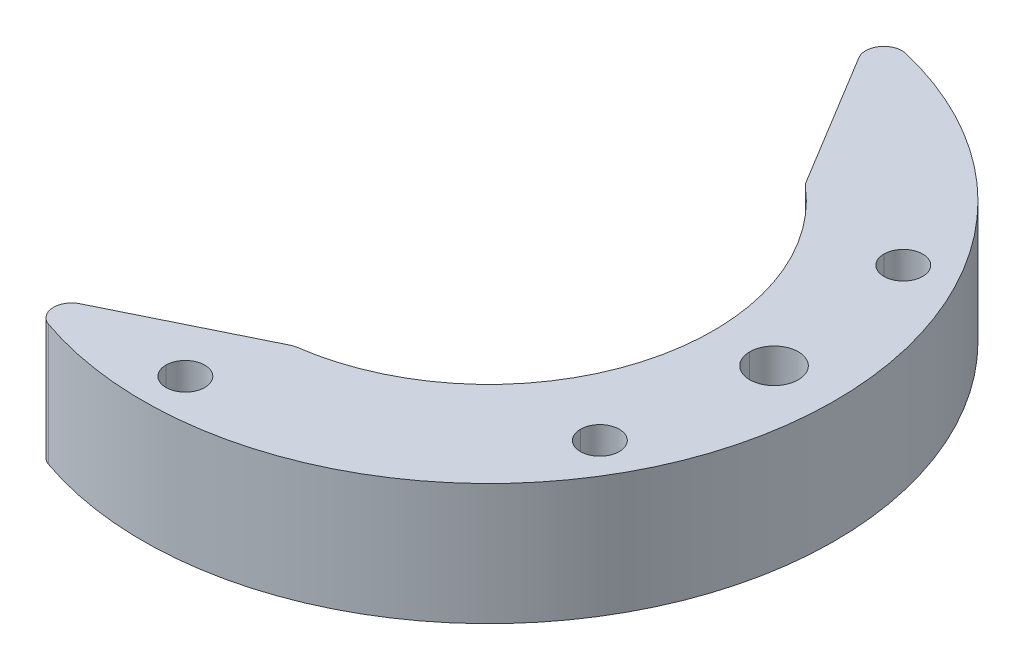
ISO-10303-21;
HEADER;
FILE_DESCRIPTION(('STEP AP214'),'2;1');
FILE_NAME('part.step','',(''),(''),'','','');
FILE_SCHEMA(('AUTOMOTIVE_DESIGN { 1 0 10303 214 1 1 1 1 }'));
ENDSEC;
DATA;
#1=APPLICATION_CONTEXT('core data for automotive mechanical design processes');
#2=APPLICATION_PROTOCOL_DEFINITION('international standard','automotive_design',2000,#1);
#3=PRODUCT_CONTEXT('',#1,'mechanical');
#4=PRODUCT('Part','Part','',(#3));
#5=PRODUCT_RELATED_PRODUCT_CATEGORY('part','',(#4));
#6=PRODUCT_DEFINITION_FORMATION('','',#4);
#7=PRODUCT_DEFINITION_CONTEXT('part definition',#1,'design');
#8=PRODUCT_DEFINITION('design','',#6,#7);
#9=PRODUCT_DEFINITION_SHAPE('','',#8);
#10=(LENGTH_UNIT() NAMED_UNIT(*) SI_UNIT(.MILLI.,.METRE.));
#11=(NAMED_UNIT(*) PLANE_ANGLE_UNIT() SI_UNIT($,.RADIAN.));
#12=(NAMED_UNIT(*) SI_UNIT($,.STERADIAN.) SOLID_ANGLE_UNIT());
#13=UNCERTAINTY_MEASURE_WITH_UNIT(LENGTH_MEASURE(1.E-05),#10,'distance_accuracy_value','');
#14=(GEOMETRIC_REPRESENTATION_CONTEXT(3) GLOBAL_UNCERTAINTY_ASSIGNED_CONTEXT((#13)) GLOBAL_UNIT_ASSIGNED_CONTEXT((#10,
#11,#12)) REPRESENTATION_CONTEXT('',''));
#15=CARTESIAN_POINT('',(0.,0.,0.));
#16=DIRECTION('',(0.,0.,1.));
#17=DIRECTION('',(1.,0.,0.));
#18=AXIS2_PLACEMENT_3D('',#15,#16,#17);
#19=CARTESIAN_POINT('',(23.5,-5.,0.));
#20=DIRECTION('',(0.,-1.,0.));
#21=DIRECTION('',(1.,0.,0.));
#22=AXIS2_PLACEMENT_3D('',#19,#20,#21);
#23=CYLINDRICAL_SURFACE('',#22,2.);
#24=DIRECTION('',(0.,1.,0.));
#25=VECTOR('',#24,1.);
#26=CARTESIAN_POINT('',(21.5,-5.,0.));
#27=LINE('',#26,#25);
#28=CARTESIAN_POINT('',(21.5,-5.,0.));
#29=VERTEX_POINT('',#28);
#30=CARTESIAN_POINT('',(21.5,5.,0.));
#31=VERTEX_POINT('',#30);
#32=EDGE_CURVE('E12',#29,#31,#27,.T.);
#33=ORIENTED_EDGE('',*,*,#32,.F.);
#34=CARTESIAN_POINT('',(23.5,-5.,0.));
#35=DIRECTION('',(0.,-1.,0.));
#36=DIRECTION('',(-1.,0.,0.));
#37=AXIS2_PLACEMENT_3D('',#34,#35,#36);
#38=CIRCLE('',#37,2.);
#39=CARTESIAN_POINT('',(25.5,-5.,0.));
#40=VERTEX_POINT('',#39);
#41=EDGE_CURVE('E29',#29,#40,#38,.T.);
#42=ORIENTED_EDGE('',*,*,#41,.T.);
#43=DIRECTION('',(0.,1.,0.));
#44=VECTOR('',#43,1.);
#45=CARTESIAN_POINT('',(25.5,-5.,0.));
#46=LINE('',#45,#44);
#47=CARTESIAN_POINT('',(25.5,5.,0.));
#48=VERTEX_POINT('',#47);
#49=EDGE_CURVE('E210',#40,#48,#46,.T.);
#50=ORIENTED_EDGE('',*,*,#49,.T.);
#51=CARTESIAN_POINT('',(23.5,5.,0.));
#52=DIRECTION('',(0.,-1.,0.));
#53=DIRECTION('',(-1.,0.,0.));
#54=AXIS2_PLACEMENT_3D('',#51,#52,#53);
#55=CIRCLE('',#54,2.);
#56=EDGE_CURVE('E214',#31,#48,#55,.T.);
#57=ORIENTED_EDGE('',*,*,#56,.F.);
#58=EDGE_LOOP('',(#33,#42,#50,#57));
#59=FACE_BOUND('',#58,.T.);
#60=ADVANCED_FACE('F20',(#59),#23,.F.);
#61=CARTESIAN_POINT('',(23.5,-5.,0.));
#62=DIRECTION('',(0.,-1.,0.));
#63=DIRECTION('',(1.,0.,0.));
#64=AXIS2_PLACEMENT_3D('',#61,#62,#63);
#65=CYLINDRICAL_SURFACE('',#64,2.);
#66=ORIENTED_EDGE('',*,*,#49,.F.);
#67=CARTESIAN_POINT('',(23.5,-5.,0.));
#68=DIRECTION('',(0.,-1.,0.));
#69=DIRECTION('',(1.,0.,0.));
#70=AXIS2_PLACEMENT_3D('',#67,#68,#69);
#71=CIRCLE('',#70,2.);
#72=EDGE_CURVE('E219',#40,#29,#71,.T.);
#73=ORIENTED_EDGE('',*,*,#72,.T.);
#74=ORIENTED_EDGE('',*,*,#32,.T.);
#75=CARTESIAN_POINT('',(23.5,5.,0.));
#76=DIRECTION('',(0.,-1.,0.));
#77=DIRECTION('',(1.,0.,0.));
#78=AXIS2_PLACEMENT_3D('',#75,#76,#77);
#79=CIRCLE('',#78,2.);
#80=EDGE_CURVE('E227',#48,#31,#79,.T.);
#81=ORIENTED_EDGE('',*,*,#80,.F.);
#82=EDGE_LOOP('',(#66,#73,#74,#81));
#83=FACE_BOUND('',#82,.T.);
#84=ADVANCED_FACE('F504',(#83),#65,.F.);
#85=CARTESIAN_POINT('',(0.,-5.,25.));
#86=DIRECTION('',(0.,-1.,0.));
#87=DIRECTION('',(1.,0.,0.));
#88=AXIS2_PLACEMENT_3D('',#85,#86,#87);
#89=CYLINDRICAL_SURFACE('',#88,1.6);
#90=DIRECTION('',(0.,1.,0.));
#91=VECTOR('',#90,1.);
#92=CARTESIAN_POINT('',(1.6,-2.,25.));
#93=LINE('',#92,#91);
#94=CARTESIAN_POINT('',(1.6,-2.,25.));
#95=VERTEX_POINT('',#94);
#96=CARTESIAN_POINT('',(1.6,5.,25.));
#97=VERTEX_POINT('',#96);
#98=EDGE_CURVE('E231',#95,#97,#93,.T.);
#99=ORIENTED_EDGE('',*,*,#98,.T.);
#100=CARTESIAN_POINT('',(0.,5.,25.));
#101=DIRECTION('',(0.,-1.,0.));
#102=DIRECTION('',(-1.,0.,0.));
#103=AXIS2_PLACEMENT_3D('',#100,#101,#102);
#104=CIRCLE('',#103,1.6);
#105=CARTESIAN_POINT('',(-1.6,5.,25.));
#106=VERTEX_POINT('',#105);
#107=EDGE_CURVE('E235',#106,#97,#104,.T.);
#108=ORIENTED_EDGE('',*,*,#107,.F.);
#109=DIRECTION('',(0.,1.,0.));
#110=VECTOR('',#109,1.);
#111=CARTESIAN_POINT('',(-1.6,-2.,25.));
#112=LINE('',#111,#110);
#113=CARTESIAN_POINT('',(-1.6,-2.,25.));
#114=VERTEX_POINT('',#113);
#115=EDGE_CURVE('E240',#114,#106,#112,.T.);
#116=ORIENTED_EDGE('',*,*,#115,.F.);
#117=CARTESIAN_POINT('',(0.,-2.,25.));
#118=DIRECTION('',(0.,-1.,0.));
#119=DIRECTION('',(-1.,0.,0.));
#120=AXIS2_PLACEMENT_3D('',#117,#118,#119);
#121=CIRCLE('',#120,1.6);
#122=EDGE_CURVE('E254',#114,#95,#121,.T.);
#123=ORIENTED_EDGE('',*,*,#122,.T.);
#124=EDGE_LOOP('',(#99,#108,#116,#123));
#125=FACE_BOUND('',#124,.T.);
#126=ADVANCED_FACE('F508',(#125),#89,.F.);
#127=CARTESIAN_POINT('',(0.,-5.,25.));
#128=DIRECTION('',(0.,-1.,0.));
#129=DIRECTION('',(1.,0.,0.));
#130=AXIS2_PLACEMENT_3D('',#127,#128,#129);
#131=CYLINDRICAL_SURFACE('',#130,1.6);
#132=ORIENTED_EDGE('',*,*,#115,.T.);
#133=CARTESIAN_POINT('',(0.,5.,25.));
#134=DIRECTION('',(0.,-1.,0.));
#135=DIRECTION('',(1.,0.,0.));
#136=AXIS2_PLACEMENT_3D('',#133,#134,#135);
#137=CIRCLE('',#136,1.6);
#138=EDGE_CURVE('E249',#97,#106,#137,.T.);
#139=ORIENTED_EDGE('',*,*,#138,.F.);
#140=ORIENTED_EDGE('',*,*,#98,.F.);
#141=CARTESIAN_POINT('',(0.,-2.,25.));
#142=DIRECTION('',(0.,-1.,0.));
#143=DIRECTION('',(1.,0.,0.));
#144=AXIS2_PLACEMENT_3D('',#141,#142,#143);
#145=CIRCLE('',#144,1.6);
#146=EDGE_CURVE('E255',#95,#114,#145,.T.);
#147=ORIENTED_EDGE('',*,*,#146,.T.);
#148=EDGE_LOOP('',(#132,#139,#140,#147));
#149=FACE_BOUND('',#148,.T.);
#150=ADVANCED_FACE('F513',(#149),#131,.F.);
#151=CARTESIAN_POINT('',(0.,-2.,0.));
#152=DIRECTION('',(0.,-1.,0.));
#153=DIRECTION('',(1.,0.,0.));
#154=AXIS2_PLACEMENT_3D('',#151,#152,#153);
#155=PLANE('',#154);
#156=ORIENTED_EDGE('',*,*,#122,.F.);
#157=ORIENTED_EDGE('',*,*,#146,.F.);
#158=EDGE_LOOP('',(#156,#157));
#159=FACE_BOUND('',#158,.T.);
#160=CARTESIAN_POINT('',(0.,-2.,25.));
#161=DIRECTION('',(0.,-1.,0.));
#162=DIRECTION('',(-1.,0.,0.));
#163=AXIS2_PLACEMENT_3D('',#160,#161,#162);
#164=CIRCLE('',#163,2.75);
#165=CARTESIAN_POINT('',(-2.75,-2.,25.));
#166=VERTEX_POINT('',#165);
#167=CARTESIAN_POINT('',(2.75,-2.,25.));
#168=VERTEX_POINT('',#167);
#169=EDGE_CURVE('E792',#166,#168,#164,.T.);
#170=ORIENTED_EDGE('',*,*,#169,.T.);
#171=CARTESIAN_POINT('',(0.,-2.,25.));
#172=DIRECTION('',(0.,-1.,0.));
#173=DIRECTION('',(1.,0.,0.));
#174=AXIS2_PLACEMENT_3D('',#171,#172,#173);
#175=CIRCLE('',#174,2.75);
#176=EDGE_CURVE('E794',#168,#166,#175,.T.);
#177=ORIENTED_EDGE('',*,*,#176,.T.);
#178=EDGE_LOOP('',(#170,#177));
#179=FACE_BOUND('',#178,.T.);
#180=ADVANCED_FACE('F519',(#159,#179),#155,.T.);
#181=CARTESIAN_POINT('',(0.,-5.,25.));
#182=DIRECTION('',(0.,-1.,0.));
#183=DIRECTION('',(1.,0.,0.));
#184=AXIS2_PLACEMENT_3D('',#181,#182,#183);
#185=CYLINDRICAL_SURFACE('',#184,2.75);
#186=DIRECTION('',(0.,1.,0.));
#187=VECTOR('',#186,1.);
#188=CARTESIAN_POINT('',(2.75,-5.,25.));
#189=LINE('',#188,#187);
#190=CARTESIAN_POINT('',(2.75,-5.,25.));
#191=VERTEX_POINT('',#190);
#192=EDGE_CURVE('E796',#191,#168,#189,.T.);
#193=ORIENTED_EDGE('',*,*,#192,.T.);
#194=ORIENTED_EDGE('',*,*,#169,.F.);
#195=DIRECTION('',(0.,1.,0.));
#196=VECTOR('',#195,1.);
#197=CARTESIAN_POINT('',(-2.75,-5.,25.));
#198=LINE('',#197,#196);
#199=CARTESIAN_POINT('',(-2.75,-5.,25.));
#200=VERTEX_POINT('',#199);
#201=EDGE_CURVE('E800',#200,#166,#198,.T.);
#202=ORIENTED_EDGE('',*,*,#201,.F.);
#203=CARTESIAN_POINT('',(0.,-5.,25.));
#204=DIRECTION('',(0.,-1.,0.));
#205=DIRECTION('',(-1.,0.,0.));
#206=AXIS2_PLACEMENT_3D('',#203,#204,#205);
#207=CIRCLE('',#206,2.75);
#208=EDGE_CURVE('E803',#200,#191,#207,.T.);
#209=ORIENTED_EDGE('',*,*,#208,.T.);
#210=EDGE_LOOP('',(#193,#194,#202,#209));
#211=FACE_BOUND('',#210,.T.);
#212=ADVANCED_FACE('F523',(#211),#185,.F.);
#213=CARTESIAN_POINT('',(0.,-5.,25.));
#214=DIRECTION('',(0.,-1.,0.));
#215=DIRECTION('',(1.,0.,0.));
#216=AXIS2_PLACEMENT_3D('',#213,#214,#215);
#217=CYLINDRICAL_SURFACE('',#216,2.75);
#218=ORIENTED_EDGE('',*,*,#201,.T.);
#219=ORIENTED_EDGE('',*,*,#176,.F.);
#220=ORIENTED_EDGE('',*,*,#192,.F.);
#221=CARTESIAN_POINT('',(0.,-5.,25.));
#222=DIRECTION('',(0.,-1.,0.));
#223=DIRECTION('',(1.,0.,0.));
#224=AXIS2_PLACEMENT_3D('',#221,#222,#223);
#225=CIRCLE('',#224,2.75);
#226=EDGE_CURVE('E806',#191,#200,#225,.T.);
#227=ORIENTED_EDGE('',*,*,#226,.T.);
#228=EDGE_LOOP('',(#218,#219,#220,#227));
#229=FACE_BOUND('',#228,.T.);
#230=ADVANCED_FACE('F527',(#229),#217,.F.);
#231=CARTESIAN_POINT('',(21.650635094611,-5.,12.5));
#232=DIRECTION('',(0.,-1.,0.));
#233=DIRECTION('',(1.,0.,0.));
#234=AXIS2_PLACEMENT_3D('',#231,#232,#233);
#235=CYLINDRICAL_SURFACE('',#234,1.6);
#236=DIRECTION('',(0.,1.,0.));
#237=VECTOR('',#236,1.);
#238=CARTESIAN_POINT('',(23.250635094611,-2.,12.5));
#239=LINE('',#238,#237);
#240=CARTESIAN_POINT('',(23.250635094611,-2.,12.5));
#241=VERTEX_POINT('',#240);
#242=CARTESIAN_POINT('',(23.250635094611,5.,12.5));
#243=VERTEX_POINT('',#242);
#244=EDGE_CURVE('E810',#241,#243,#239,.T.);
#245=ORIENTED_EDGE('',*,*,#244,.T.);
#246=CARTESIAN_POINT('',(21.650635094611,5.,12.5));
#247=DIRECTION('',(0.,-1.,0.));
#248=DIRECTION('',(-1.,0.,0.));
#249=AXIS2_PLACEMENT_3D('',#246,#247,#248);
#250=CIRCLE('',#249,1.6);
#251=CARTESIAN_POINT('',(20.050635094611,5.,12.5));
#252=VERTEX_POINT('',#251);
#253=EDGE_CURVE('E782',#252,#243,#250,.T.);
#254=ORIENTED_EDGE('',*,*,#253,.F.);
#255=DIRECTION('',(0.,1.,0.));
#256=VECTOR('',#255,1.);
#257=CARTESIAN_POINT('',(20.050635094611,-2.,12.5));
#258=LINE('',#257,#256);
#259=CARTESIAN_POINT('',(20.050635094611,-2.,12.5));
#260=VERTEX_POINT('',#259);
#261=EDGE_CURVE('E814',#260,#252,#258,.T.);
#262=ORIENTED_EDGE('',*,*,#261,.F.);
#263=CARTESIAN_POINT('',(21.650635094611,-2.,12.5));
#264=DIRECTION('',(0.,-1.,0.));
#265=DIRECTION('',(-1.,0.,0.));
#266=AXIS2_PLACEMENT_3D('',#263,#264,#265);
#267=CIRCLE('',#266,1.6);
#268=EDGE_CURVE('E818',#260,#241,#267,.T.);
#269=ORIENTED_EDGE('',*,*,#268,.T.);
#270=EDGE_LOOP('',(#245,#254,#262,#269));
#271=FACE_BOUND('',#270,.T.);
#272=ADVANCED_FACE('F531',(#271),#235,.F.);
#273=CARTESIAN_POINT('',(21.650635094611,-5.,12.5));
#274=DIRECTION('',(0.,-1.,0.));
#275=DIRECTION('',(1.,0.,0.));
#276=AXIS2_PLACEMENT_3D('',#273,#274,#275);
#277=CYLINDRICAL_SURFACE('',#276,1.6);
#278=ORIENTED_EDGE('',*,*,#261,.T.);
#279=CARTESIAN_POINT('',(21.650635094611,5.,12.5));
#280=DIRECTION('',(0.,-1.,0.));
#281=DIRECTION('',(1.,0.,0.));
#282=AXIS2_PLACEMENT_3D('',#279,#280,#281);
#283=CIRCLE('',#282,1.6);
#284=EDGE_CURVE('E280',#243,#252,#283,.T.);
#285=ORIENTED_EDGE('',*,*,#284,.F.);
#286=ORIENTED_EDGE('',*,*,#244,.F.);
#287=CARTESIAN_POINT('',(21.650635094611,-2.,12.5));
#288=DIRECTION('',(0.,-1.,0.));
#289=DIRECTION('',(1.,0.,0.));
#290=AXIS2_PLACEMENT_3D('',#287,#288,#289);
#291=CIRCLE('',#290,1.6);
#292=EDGE_CURVE('E272',#241,#260,#291,.T.);
#293=ORIENTED_EDGE('',*,*,#292,.T.);
#294=EDGE_LOOP('',(#278,#285,#286,#293));
#295=FACE_BOUND('',#294,.T.);
#296=ADVANCED_FACE('F535',(#295),#277,.F.);
#297=CARTESIAN_POINT('',(0.,-2.,0.));
#298=DIRECTION('',(0.,-1.,0.));
#299=DIRECTION('',(1.,0.,0.));
#300=AXIS2_PLACEMENT_3D('',#297,#298,#299);
#301=PLANE('',#300);
#302=ORIENTED_EDGE('',*,*,#268,.F.);
#303=ORIENTED_EDGE('',*,*,#292,.F.);
#304=EDGE_LOOP('',(#302,#303));
#305=FACE_BOUND('',#304,.T.);
#306=CARTESIAN_POINT('',(21.650635094611,-2.,12.5));
#307=DIRECTION('',(0.,-1.,0.));
#308=DIRECTION('',(-1.,0.,0.));
#309=AXIS2_PLACEMENT_3D('',#306,#307,#308);
#310=CIRCLE('',#309,2.75);
#311=CARTESIAN_POINT('',(18.900635094611,-2.,12.5));
#312=VERTEX_POINT('',#311);
#313=CARTESIAN_POINT('',(24.400635094611,-2.,12.5));
#314=VERTEX_POINT('',#313);
#315=EDGE_CURVE('E267',#312,#314,#310,.T.);
#316=ORIENTED_EDGE('',*,*,#315,.T.);
#317=CARTESIAN_POINT('',(21.650635094611,-2.,12.5));
#318=DIRECTION('',(0.,-1.,0.));
#319=DIRECTION('',(1.,0.,0.));
#320=AXIS2_PLACEMENT_3D('',#317,#318,#319);
#321=CIRCLE('',#320,2.75);
#322=EDGE_CURVE('E273',#314,#312,#321,.T.);
#323=ORIENTED_EDGE('',*,*,#322,.T.);
#324=EDGE_LOOP('',(#316,#323));
#325=FACE_BOUND('',#324,.T.);
#326=ADVANCED_FACE('F539',(#305,#325),#301,.T.);
#327=CARTESIAN_POINT('',(21.650635094611,-5.,12.5));
#328=DIRECTION('',(0.,-1.,0.));
#329=DIRECTION('',(1.,0.,0.));
#330=AXIS2_PLACEMENT_3D('',#327,#328,#329);
#331=CYLINDRICAL_SURFACE('',#330,2.75);
#332=DIRECTION('',(0.,1.,0.));
#333=VECTOR('',#332,1.);
#334=CARTESIAN_POINT('',(24.400635094611,-5.,12.5));
#335=LINE('',#334,#333);
#336=CARTESIAN_POINT('',(24.400635094611,-5.,12.5));
#337=VERTEX_POINT('',#336);
#338=EDGE_CURVE('E302',#337,#314,#335,.T.);
#339=ORIENTED_EDGE('',*,*,#338,.T.);
#340=ORIENTED_EDGE('',*,*,#315,.F.);
#341=DIRECTION('',(0.,1.,0.));
#342=VECTOR('',#341,1.);
#343=CARTESIAN_POINT('',(18.900635094611,-5.,12.5));
#344=LINE('',#343,#342);
#345=CARTESIAN_POINT('',(18.900635094611,-5.,12.5));
#346=VERTEX_POINT('',#345);
#347=EDGE_CURVE('E295',#346,#312,#344,.T.);
#348=ORIENTED_EDGE('',*,*,#347,.F.);
#349=CARTESIAN_POINT('',(21.650635094611,-5.,12.5));
#350=DIRECTION('',(0.,-1.,0.));
#351=DIRECTION('',(-1.,0.,0.));
#352=AXIS2_PLACEMENT_3D('',#349,#350,#351);
#353=CIRCLE('',#352,2.75);
#354=EDGE_CURVE('E291',#346,#337,#353,.T.);
#355=ORIENTED_EDGE('',*,*,#354,.T.);
#356=EDGE_LOOP('',(#339,#340,#348,#355));
#357=FACE_BOUND('',#356,.T.);
#358=ADVANCED_FACE('F543',(#357),#331,.F.);
#359=CARTESIAN_POINT('',(21.650635094611,-5.,12.5));
#360=DIRECTION('',(0.,-1.,0.));
#361=DIRECTION('',(1.,0.,0.));
#362=AXIS2_PLACEMENT_3D('',#359,#360,#361);
#363=CYLINDRICAL_SURFACE('',#362,2.75);
#364=ORIENTED_EDGE('',*,*,#347,.T.);
#365=ORIENTED_EDGE('',*,*,#322,.F.);
#366=ORIENTED_EDGE('',*,*,#338,.F.);
#367=CARTESIAN_POINT('',(21.650635094611,-5.,12.5));
#368=DIRECTION('',(0.,-1.,0.));
#369=DIRECTION('',(1.,0.,0.));
#370=AXIS2_PLACEMENT_3D('',#367,#368,#369);
#371=CIRCLE('',#370,2.75);
#372=EDGE_CURVE('E296',#337,#346,#371,.T.);
#373=ORIENTED_EDGE('',*,*,#372,.T.);
#374=EDGE_LOOP('',(#364,#365,#366,#373));
#375=FACE_BOUND('',#374,.T.);
#376=ADVANCED_FACE('F547',(#375),#363,.F.);
#377=CARTESIAN_POINT('',(21.650635094611,-5.,-12.5));
#378=DIRECTION('',(0.,-1.,0.));
#379=DIRECTION('',(1.,0.,0.));
#380=AXIS2_PLACEMENT_3D('',#377,#378,#379);
#381=CYLINDRICAL_SURFACE('',#380,1.6);
#382=DIRECTION('',(0.,1.,0.));
#383=VECTOR('',#382,1.);
#384=CARTESIAN_POINT('',(23.250635094611,-2.,-12.5));
#385=LINE('',#384,#383);
#386=CARTESIAN_POINT('',(23.250635094611,-2.,-12.5));
#387=VERTEX_POINT('',#386);
#388=CARTESIAN_POINT('',(23.250635094611,5.,-12.5));
#389=VERTEX_POINT('',#388);
#390=EDGE_CURVE('E312',#387,#389,#385,.T.);
#391=ORIENTED_EDGE('',*,*,#390,.T.);
#392=CARTESIAN_POINT('',(21.650635094611,5.,-12.5));
#393=DIRECTION('',(0.,-1.,0.));
#394=DIRECTION('',(-1.,0.,0.));
#395=AXIS2_PLACEMENT_3D('',#392,#393,#394);
#396=CIRCLE('',#395,1.6);
#397=CARTESIAN_POINT('',(20.050635094611,5.,-12.5));
#398=VERTEX_POINT('',#397);
#399=EDGE_CURVE('E315',#398,#389,#396,.T.);
#400=ORIENTED_EDGE('',*,*,#399,.F.);
#401=DIRECTION('',(0.,1.,0.));
#402=VECTOR('',#401,1.);
#403=CARTESIAN_POINT('',(20.050635094611,-2.,-12.5));
#404=LINE('',#403,#402);
#405=CARTESIAN_POINT('',(20.050635094611,-2.,-12.5));
#406=VERTEX_POINT('',#405);
#407=EDGE_CURVE('E320',#406,#398,#404,.T.);
#408=ORIENTED_EDGE('',*,*,#407,.F.);
#409=CARTESIAN_POINT('',(21.650635094611,-2.,-12.5));
#410=DIRECTION('',(0.,-1.,0.));
#411=DIRECTION('',(-1.,0.,0.));
#412=AXIS2_PLACEMENT_3D('',#409,#410,#411);
#413=CIRCLE('',#412,1.6);
#414=EDGE_CURVE('E325',#406,#387,#413,.T.);
#415=ORIENTED_EDGE('',*,*,#414,.T.);
#416=EDGE_LOOP('',(#391,#400,#408,#415));
#417=FACE_BOUND('',#416,.T.);
#418=ADVANCED_FACE('F551',(#417),#381,.F.);
#419=CARTESIAN_POINT('',(21.650635094611,-5.,-12.5));
#420=DIRECTION('',(0.,-1.,0.));
#421=DIRECTION('',(1.,0.,0.));
#422=AXIS2_PLACEMENT_3D('',#419,#420,#421);
#423=CYLINDRICAL_SURFACE('',#422,1.6);
#424=ORIENTED_EDGE('',*,*,#407,.T.);
#425=CARTESIAN_POINT('',(21.650635094611,5.,-12.5));
#426=DIRECTION('',(0.,-1.,0.));
#427=DIRECTION('',(1.,0.,0.));
#428=AXIS2_PLACEMENT_3D('',#425,#426,#427);
#429=CIRCLE('',#428,1.6);
#430=EDGE_CURVE('E332',#389,#398,#429,.T.);
#431=ORIENTED_EDGE('',*,*,#430,.F.);
#432=ORIENTED_EDGE('',*,*,#390,.F.);
#433=CARTESIAN_POINT('',(21.650635094611,-2.,-12.5));
#434=DIRECTION('',(0.,-1.,0.));
#435=DIRECTION('',(1.,0.,0.));
#436=AXIS2_PLACEMENT_3D('',#433,#434,#435);
#437=CIRCLE('',#436,1.6);
#438=EDGE_CURVE('E337',#387,#406,#437,.T.);
#439=ORIENTED_EDGE('',*,*,#438,.T.);
#440=EDGE_LOOP('',(#424,#431,#432,#439));
#441=FACE_BOUND('',#440,.T.);
#442=ADVANCED_FACE('F555',(#441),#423,.F.);
#443=CARTESIAN_POINT('',(0.,-2.,0.));
#444=DIRECTION('',(0.,-1.,0.));
#445=DIRECTION('',(1.,0.,0.));
#446=AXIS2_PLACEMENT_3D('',#443,#444,#445);
#447=PLANE('',#446);
#448=ORIENTED_EDGE('',*,*,#414,.F.);
#449=ORIENTED_EDGE('',*,*,#438,.F.);
#450=EDGE_LOOP('',(#448,#449));
#451=FACE_BOUND('',#450,.T.);
#452=CARTESIAN_POINT('',(21.650635094611,-2.,-12.5));
#453=DIRECTION('',(0.,-1.,0.));
#454=DIRECTION('',(-1.,0.,0.));
#455=AXIS2_PLACEMENT_3D('',#452,#453,#454);
#456=CIRCLE('',#455,2.75);
#457=CARTESIAN_POINT('',(18.900635094611,-2.,-12.5));
#458=VERTEX_POINT('',#457);
#459=CARTESIAN_POINT('',(24.400635094611,-2.,-12.5));
#460=VERTEX_POINT('',#459);
#461=EDGE_CURVE('E342',#458,#460,#456,.T.);
#462=ORIENTED_EDGE('',*,*,#461,.T.);
#463=CARTESIAN_POINT('',(21.650635094611,-2.,-12.5));
#464=DIRECTION('',(0.,-1.,0.));
#465=DIRECTION('',(1.,0.,0.));
#466=AXIS2_PLACEMENT_3D('',#463,#464,#465);
#467=CIRCLE('',#466,2.75);
#468=EDGE_CURVE('E367',#460,#458,#467,.T.);
#469=ORIENTED_EDGE('',*,*,#468,.T.);
#470=EDGE_LOOP('',(#462,#469));
#471=FACE_BOUND('',#470,.T.);
#472=ADVANCED_FACE('F559',(#451,#471),#447,.T.);
#473=CARTESIAN_POINT('',(21.650635094611,-5.,-12.5));
#474=DIRECTION('',(0.,-1.,0.));
#475=DIRECTION('',(1.,0.,0.));
#476=AXIS2_PLACEMENT_3D('',#473,#474,#475);
#477=CYLINDRICAL_SURFACE('',#476,2.75);
#478=DIRECTION('',(0.,1.,0.));
#479=VECTOR('',#478,1.);
#480=CARTESIAN_POINT('',(24.400635094611,-5.,-12.5));
#481=LINE('',#480,#479);
#482=CARTESIAN_POINT('',(24.400635094611,-5.,-12.5));
#483=VERTEX_POINT('',#482);
#484=EDGE_CURVE('E361',#483,#460,#481,.T.);
#485=ORIENTED_EDGE('',*,*,#484,.T.);
#486=ORIENTED_EDGE('',*,*,#461,.F.);
#487=DIRECTION('',(0.,1.,0.));
#488=VECTOR('',#487,1.);
#489=CARTESIAN_POINT('',(18.900635094611,-5.,-12.5));
#490=LINE('',#489,#488);
#491=CARTESIAN_POINT('',(18.900635094611,-5.,-12.5));
#492=VERTEX_POINT('',#491);
#493=EDGE_CURVE('E354',#492,#458,#490,.T.);
#494=ORIENTED_EDGE('',*,*,#493,.F.);
#495=CARTESIAN_POINT('',(21.650635094611,-5.,-12.5));
#496=DIRECTION('',(0.,-1.,0.));
#497=DIRECTION('',(-1.,0.,0.));
#498=AXIS2_PLACEMENT_3D('',#495,#496,#497);
#499=CIRCLE('',#498,2.75);
#500=EDGE_CURVE('E350',#492,#483,#499,.T.);
#501=ORIENTED_EDGE('',*,*,#500,.T.);
#502=EDGE_LOOP('',(#485,#486,#494,#501));
#503=FACE_BOUND('',#502,.T.);
#504=ADVANCED_FACE('F378',(#503),#477,.F.);
#505=CARTESIAN_POINT('',(21.650635094611,-5.,-12.5));
#506=DIRECTION('',(0.,-1.,0.));
#507=DIRECTION('',(1.,0.,0.));
#508=AXIS2_PLACEMENT_3D('',#505,#506,#507);
#509=CYLINDRICAL_SURFACE('',#508,2.75);
#510=ORIENTED_EDGE('',*,*,#493,.T.);
#511=ORIENTED_EDGE('',*,*,#468,.F.);
#512=ORIENTED_EDGE('',*,*,#484,.F.);
#513=CARTESIAN_POINT('',(21.650635094611,-5.,-12.5));
#514=DIRECTION('',(0.,-1.,0.));
#515=DIRECTION('',(1.,0.,0.));
#516=AXIS2_PLACEMENT_3D('',#513,#514,#515);
#517=CIRCLE('',#516,2.75);
#518=EDGE_CURVE('E355',#483,#492,#517,.T.);
#519=ORIENTED_EDGE('',*,*,#518,.T.);
#520=EDGE_LOOP('',(#510,#511,#512,#519));
#521=FACE_BOUND('',#520,.T.);
#522=ADVANCED_FACE('F383',(#521),#509,.F.);
#523=CARTESIAN_POINT('',(0.,-5.,0.));
#524=DIRECTION('',(0.,-1.,0.));
#525=DIRECTION('',(1.,0.,0.));
#526=AXIS2_PLACEMENT_3D('',#523,#524,#525);
#527=PLANE('',#526);
#528=ORIENTED_EDGE('',*,*,#41,.F.);
#529=ORIENTED_EDGE('',*,*,#72,.F.);
#530=EDGE_LOOP('',(#528,#529));
#531=FACE_BOUND('',#530,.T.);
#532=ORIENTED_EDGE('',*,*,#208,.F.);
#533=ORIENTED_EDGE('',*,*,#226,.F.);
#534=EDGE_LOOP('',(#532,#533));
#535=FACE_BOUND('',#534,.T.);
#536=ORIENTED_EDGE('',*,*,#354,.F.);
#537=ORIENTED_EDGE('',*,*,#372,.F.);
#538=EDGE_LOOP('',(#536,#537));
#539=FACE_BOUND('',#538,.T.);
#540=ORIENTED_EDGE('',*,*,#500,.F.);
#541=ORIENTED_EDGE('',*,*,#518,.F.);
#542=EDGE_LOOP('',(#540,#541));
#543=FACE_BOUND('',#542,.T.);
#544=CARTESIAN_POINT('',(0.,-5.,0.));
#545=DIRECTION('',(0.,-1.,0.));
#546=DIRECTION('',(0.233104454531094,0.,-0.972451702285394));
#547=AXIS2_PLACEMENT_3D('',#544,#545,#546);
#548=CIRCLE('',#547,28.5);
#549=CARTESIAN_POINT('',(6.64347695413618,-5.,-27.7148735151337));
#550=VERTEX_POINT('',#549);
#551=CARTESIAN_POINT('',(-9.34455007267337,-5.,26.9245126964129));
#552=VERTEX_POINT('',#551);
#553=EDGE_CURVE('E386',#550,#552,#548,.T.);
#554=ORIENTED_EDGE('',*,*,#553,.T.);
#555=CARTESIAN_POINT('',(-8.85273164779584,-5.,25.5074330808122));
#556=DIRECTION('',(0.,-1.,0.));
#557=DIRECTION('',(-0.327878949918358,0.,0.944719743733788));
#558=AXIS2_PLACEMENT_3D('',#555,#556,#557);
#559=CIRCLE('',#558,1.5);
#560=CARTESIAN_POINT('',(-9.51346314014744,-5.,24.1607950837934));
#561=VERTEX_POINT('',#560);
#562=EDGE_CURVE('E396',#552,#561,#559,.T.);
#563=ORIENTED_EDGE('',*,*,#562,.T.);
#564=DIRECTION('',(0.897758664679207,0.,-0.44048766156773));
#565=VECTOR('',#564,1.);
#566=CARTESIAN_POINT('',(-9.51346314014744,-5.,24.1607950837934));
#567=LINE('',#566,#565);
#568=CARTESIAN_POINT('',(2.10203301346879,-5.,18.4616211966958));
#569=VERTEX_POINT('',#568);
#570=EDGE_CURVE('E411',#561,#569,#567,.T.);
#571=ORIENTED_EDGE('',*,*,#570,.T.);
#572=CARTESIAN_POINT('',(2.76276450582038,-5.,19.8082591937146));
#573=DIRECTION('',(0.,-1.,0.));
#574=DIRECTION('',(-0.440487661567726,0.,-0.897758664679209));
#575=AXIS2_PLACEMENT_3D('',#572,#573,#574);
#576=CIRCLE('',#575,1.5);
#577=CARTESIAN_POINT('',(2.55555716788385,-5.,18.322639754186));
#578=VERTEX_POINT('',#577);
#579=EDGE_CURVE('E414',#569,#578,#576,.T.);
#580=ORIENTED_EDGE('',*,*,#579,.T.);
#581=CARTESIAN_POINT('',(0.,-5.,0.));
#582=DIRECTION('',(0.,1.,0.));
#583=DIRECTION('',(0.138138225291018,0.,0.99041295968573));
#584=AXIS2_PLACEMENT_3D('',#581,#582,#583);
#585=CIRCLE('',#584,18.5);
#586=CARTESIAN_POINT('',(12.029545081839,-5.,-14.0548939919162));
#587=VERTEX_POINT('',#586);
#588=EDGE_CURVE('E468',#578,#587,#585,.T.);
#589=ORIENTED_EDGE('',*,*,#588,.T.);
#590=CARTESIAN_POINT('',(13.0049136019881,-5.,-15.1944799912608));
#591=DIRECTION('',(0.,-1.,0.));
#592=DIRECTION('',(-0.650245680099409,0.,0.759723999563037));
#593=AXIS2_PLACEMENT_3D('',#590,#591,#592);
#594=CIRCLE('',#593,1.5);
#595=CARTESIAN_POINT('',(11.722477893601,-5.,-14.416432014685));
#596=VERTEX_POINT('',#595);
#597=EDGE_CURVE('E464',#587,#596,#594,.T.);
#598=ORIENTED_EDGE('',*,*,#597,.T.);
#599=DIRECTION('',(-0.518698651050486,0.,-0.854957138924757));
#600=VECTOR('',#599,1.);
#601=CARTESIAN_POINT('',(11.722477893601,-5.,-14.416432014685));
#602=LINE('',#601,#600);
#603=CARTESIAN_POINT('',(5.01138456395241,-5.,-25.4781479851299));
#604=VERTEX_POINT('',#603);
#605=EDGE_CURVE('E483',#596,#604,#602,.T.);
#606=ORIENTED_EDGE('',*,*,#605,.T.);
#607=CARTESIAN_POINT('',(6.29382027233955,-5.,-26.2561959617056));
#608=DIRECTION('',(0.,-1.,0.));
#609=DIRECTION('',(-0.854957138924756,0.,0.518698651050487));
#610=AXIS2_PLACEMENT_3D('',#607,#608,#609);
#611=CIRCLE('',#610,1.5);
#612=EDGE_CURVE('E187',#604,#550,#611,.T.);
#613=ORIENTED_EDGE('',*,*,#612,.T.);
#614=EDGE_LOOP('',(#554,#563,#571,#580,#589,#598,#606,#613));
#615=FACE_BOUND('',#614,.T.);
#616=ADVANCED_FACE('F387',(#531,#535,#539,#543,#615),#527,.T.);
#617=CARTESIAN_POINT('',(0.,5.,0.));
#618=DIRECTION('',(0.,-1.,0.));
#619=DIRECTION('',(1.,0.,0.));
#620=AXIS2_PLACEMENT_3D('',#617,#618,#619);
#621=CYLINDRICAL_SURFACE('',#620,28.5);
#622=CARTESIAN_POINT('',(0.,5.,0.));
#623=DIRECTION('',(0.,-1.,0.));
#624=DIRECTION('',(0.233104454531094,0.,-0.972451702285394));
#625=AXIS2_PLACEMENT_3D('',#622,#623,#624);
#626=CIRCLE('',#625,28.5);
#627=CARTESIAN_POINT('',(6.64347695413618,5.,-27.7148735151337));
#628=VERTEX_POINT('',#627);
#629=CARTESIAN_POINT('',(-9.34455007267337,5.,26.9245126964129));
#630=VERTEX_POINT('',#629);
#631=EDGE_CURVE('E192',#628,#630,#626,.T.);
#632=ORIENTED_EDGE('',*,*,#631,.T.);
#633=DIRECTION('',(0.,1.,0.));
#634=VECTOR('',#633,1.);
#635=CARTESIAN_POINT('',(-9.34455007267337,-5.,26.9245126964129));
#636=LINE('',#635,#634);
#637=EDGE_CURVE('E401',#552,#630,#636,.T.);
#638=ORIENTED_EDGE('',*,*,#637,.F.);
#639=ORIENTED_EDGE('',*,*,#553,.F.);
#640=DIRECTION('',(0.,1.,0.));
#641=VECTOR('',#640,1.);
#642=CARTESIAN_POINT('',(6.64347695413618,-5.,-27.7148735151337));
#643=LINE('',#642,#641);
#644=EDGE_CURVE('E404',#550,#628,#643,.T.);
#645=ORIENTED_EDGE('',*,*,#644,.T.);
#646=EDGE_LOOP('',(#632,#638,#639,#645));
#647=FACE_BOUND('',#646,.T.);
#648=ADVANCED_FACE('F390',(#647),#621,.T.);
#649=CARTESIAN_POINT('',(-8.85273164779584,-18.036,25.5074330808122));
#650=DIRECTION('',(0.,1.,0.));
#651=DIRECTION('',(-0.44048766156773,0.,-0.897758664679207));
#652=AXIS2_PLACEMENT_3D('',#649,#650,#651);
#653=CYLINDRICAL_SURFACE('',#652,1.5);
#654=DIRECTION('',(0.,1.,0.));
#655=VECTOR('',#654,1.);
#656=CARTESIAN_POINT('',(-9.51346314014743,-5.,24.1607950837934));
#657=LINE('',#656,#655);
#658=CARTESIAN_POINT('',(-9.51346314014744,5.,24.1607950837934));
#659=VERTEX_POINT('',#658);
#660=EDGE_CURVE('E408',#561,#659,#657,.T.);
#661=ORIENTED_EDGE('',*,*,#660,.F.);
#662=ORIENTED_EDGE('',*,*,#562,.F.);
#663=ORIENTED_EDGE('',*,*,#637,.T.);
#664=CARTESIAN_POINT('',(-8.85273164779584,5.,25.5074330808122));
#665=DIRECTION('',(0.,1.,0.));
#666=DIRECTION('',(-0.44048766156773,0.,-0.897758664679207));
#667=AXIS2_PLACEMENT_3D('',#664,#665,#666);
#668=CIRCLE('',#667,1.5);
#669=EDGE_CURVE('E426',#659,#630,#668,.T.);
#670=ORIENTED_EDGE('',*,*,#669,.F.);
#671=EDGE_LOOP('',(#661,#662,#663,#670));
#672=FACE_BOUND('',#671,.T.);
#673=ADVANCED_FACE('F406',(#672),#653,.T.);
#674=CARTESIAN_POINT('',(-12.486047713811,5.,25.6193015612923));
#675=DIRECTION('',(-0.44048766156773,0.,-0.897758664679207));
#676=DIRECTION('',(0.897758664679207,0.,-0.44048766156773));
#677=AXIS2_PLACEMENT_3D('',#674,#675,#676);
#678=PLANE('',#677);
#679=DIRECTION('',(0.897758664679207,0.,-0.44048766156773));
#680=VECTOR('',#679,1.);
#681=CARTESIAN_POINT('',(-9.51346314014744,5.,24.1607950837934));
#682=LINE('',#681,#680);
#683=CARTESIAN_POINT('',(2.10203301346879,5.,18.4616211966958));
#684=VERTEX_POINT('',#683);
#685=EDGE_CURVE('E421',#659,#684,#682,.T.);
#686=ORIENTED_EDGE('',*,*,#685,.T.);
#687=DIRECTION('',(0.,1.,0.));
#688=VECTOR('',#687,1.);
#689=CARTESIAN_POINT('',(2.10203301346879,-5.,18.4616211966958));
#690=LINE('',#689,#688);
#691=EDGE_CURVE('E427',#569,#684,#690,.T.);
#692=ORIENTED_EDGE('',*,*,#691,.F.);
#693=ORIENTED_EDGE('',*,*,#570,.F.);
#694=ORIENTED_EDGE('',*,*,#660,.T.);
#695=EDGE_LOOP('',(#686,#692,#693,#694));
#696=FACE_BOUND('',#695,.T.);
#697=ADVANCED_FACE('F477',(#696),#678,.T.);
#698=CARTESIAN_POINT('',(2.76276450582038,-18.036,19.8082591937146));
#699=DIRECTION('',(0.,1.,0.));
#700=DIRECTION('',(-0.138138225291024,0.,-0.990412959685729));
#701=AXIS2_PLACEMENT_3D('',#698,#699,#700);
#702=CYLINDRICAL_SURFACE('',#701,1.5);
#703=DIRECTION('',(0.,1.,0.));
#704=VECTOR('',#703,1.);
#705=CARTESIAN_POINT('',(2.55555716788386,-5.,18.322639754186));
#706=LINE('',#705,#704);
#707=CARTESIAN_POINT('',(2.55555716788386,5.,18.322639754186));
#708=VERTEX_POINT('',#707);
#709=EDGE_CURVE('E439',#578,#708,#706,.T.);
#710=ORIENTED_EDGE('',*,*,#709,.F.);
#711=ORIENTED_EDGE('',*,*,#579,.F.);
#712=ORIENTED_EDGE('',*,*,#691,.T.);
#713=CARTESIAN_POINT('',(2.76276450582039,5.,19.8082591937146));
#714=DIRECTION('',(0.,1.,0.));
#715=DIRECTION('',(-0.138138225291031,0.,-0.990412959685729));
#716=AXIS2_PLACEMENT_3D('',#713,#714,#715);
#717=CIRCLE('',#716,1.5);
#718=EDGE_CURVE('E444',#708,#684,#717,.T.);
#719=ORIENTED_EDGE('',*,*,#718,.F.);
#720=EDGE_LOOP('',(#710,#711,#712,#719));
#721=FACE_BOUND('',#720,.T.);
#722=ADVANCED_FACE('F472',(#721),#702,.T.);
#723=CARTESIAN_POINT('',(0.,5.,0.));
#724=DIRECTION('',(0.,-1.,0.));
#725=DIRECTION('',(1.,0.,0.));
#726=AXIS2_PLACEMENT_3D('',#723,#724,#725);
#727=CYLINDRICAL_SURFACE('',#726,18.5);
#728=CARTESIAN_POINT('',(0.,5.,0.));
#729=DIRECTION('',(0.,1.,0.));
#730=DIRECTION('',(0.138138225291018,0.,0.99041295968573));
#731=AXIS2_PLACEMENT_3D('',#728,#729,#730);
#732=CIRCLE('',#731,18.5);
#733=CARTESIAN_POINT('',(12.029545081839,5.,-14.0548939919162));
#734=VERTEX_POINT('',#733);
#735=EDGE_CURVE('E447',#708,#734,#732,.T.);
#736=ORIENTED_EDGE('',*,*,#735,.T.);
#737=DIRECTION('',(0.,1.,0.));
#738=VECTOR('',#737,1.);
#739=CARTESIAN_POINT('',(12.029545081839,-5.,-14.0548939919162));
#740=LINE('',#739,#738);
#741=EDGE_CURVE('E451',#587,#734,#740,.T.);
#742=ORIENTED_EDGE('',*,*,#741,.F.);
#743=ORIENTED_EDGE('',*,*,#588,.F.);
#744=ORIENTED_EDGE('',*,*,#709,.T.);
#745=EDGE_LOOP('',(#736,#742,#743,#744));
#746=FACE_BOUND('',#745,.T.);
#747=ADVANCED_FACE('F467',(#746),#727,.F.);
#748=CARTESIAN_POINT('',(13.0049136019881,-18.036,-15.1944799912608));
#749=DIRECTION('',(0.,1.,0.));
#750=DIRECTION('',(-0.854957138924757,0.,0.518698651050486));
#751=AXIS2_PLACEMENT_3D('',#748,#749,#750);
#752=CYLINDRICAL_SURFACE('',#751,1.5);
#753=DIRECTION('',(0.,1.,0.));
#754=VECTOR('',#753,1.);
#755=CARTESIAN_POINT('',(11.722477893601,-5.,-14.416432014685));
#756=LINE('',#755,#754);
#757=CARTESIAN_POINT('',(11.722477893601,5.,-14.416432014685));
#758=VERTEX_POINT('',#757);
#759=EDGE_CURVE('E174',#596,#758,#756,.T.);
#760=ORIENTED_EDGE('',*,*,#759,.F.);
#761=ORIENTED_EDGE('',*,*,#597,.F.);
#762=ORIENTED_EDGE('',*,*,#741,.T.);
#763=CARTESIAN_POINT('',(13.0049136019881,5.,-15.1944799912608));
#764=DIRECTION('',(0.,1.,0.));
#765=DIRECTION('',(-0.854957138924757,0.,0.518698651050487));
#766=AXIS2_PLACEMENT_3D('',#763,#764,#765);
#767=CIRCLE('',#766,1.5);
#768=EDGE_CURVE('E179',#758,#734,#767,.T.);
#769=ORIENTED_EDGE('',*,*,#768,.F.);
#770=EDGE_LOOP('',(#760,#761,#762,#769));
#771=FACE_BOUND('',#770,.T.);
#772=ADVANCED_FACE('F461',(#771),#752,.T.);
#773=CARTESIAN_POINT('',(11.8495580248803,5.,-14.2069692269321));
#774=DIRECTION('',(-0.854957138924757,0.,0.518698651050486));
#775=DIRECTION('',(-0.518698651050486,0.,-0.854957138924757));
#776=AXIS2_PLACEMENT_3D('',#773,#774,#775);
#777=PLANE('',#776);
#778=ORIENTED_EDGE('',*,*,#605,.F.);
#779=ORIENTED_EDGE('',*,*,#759,.T.);
#780=DIRECTION('',(-0.518698651050486,0.,-0.854957138924757));
#781=VECTOR('',#780,1.);
#782=CARTESIAN_POINT('',(11.722477893601,5.,-14.416432014685));
#783=LINE('',#782,#781);
#784=CARTESIAN_POINT('',(5.01138456395241,5.,-25.4781479851299));
#785=VERTEX_POINT('',#784);
#786=EDGE_CURVE('E167',#758,#785,#783,.T.);
#787=ORIENTED_EDGE('',*,*,#786,.T.);
#788=DIRECTION('',(0.,1.,0.));
#789=VECTOR('',#788,1.);
#790=CARTESIAN_POINT('',(5.01138456395241,-5.,-25.4781479851299));
#791=LINE('',#790,#789);
#792=EDGE_CURVE('E171',#604,#785,#791,.T.);
#793=ORIENTED_EDGE('',*,*,#792,.F.);
#794=EDGE_LOOP('',(#778,#779,#787,#793));
#795=FACE_BOUND('',#794,.T.);
#796=ADVANCED_FACE('F170',(#795),#777,.T.);
#797=CARTESIAN_POINT('',(6.29382027233955,-18.036,-26.2561959617056));
#798=DIRECTION('',(0.,1.,0.));
#799=DIRECTION('',(0.233104454531088,0.,-0.972451702285396));
#800=AXIS2_PLACEMENT_3D('',#797,#798,#799);
#801=CYLINDRICAL_SURFACE('',#800,1.5);
#802=ORIENTED_EDGE('',*,*,#644,.F.);
#803=ORIENTED_EDGE('',*,*,#612,.F.);
#804=ORIENTED_EDGE('',*,*,#792,.T.);
#805=CARTESIAN_POINT('',(6.29382027233955,5.,-26.2561959617056));
#806=DIRECTION('',(0.,1.,0.));
#807=DIRECTION('',(0.233104454531092,0.,-0.972451702285395));
#808=AXIS2_PLACEMENT_3D('',#805,#806,#807);
#809=CIRCLE('',#808,1.5);
#810=EDGE_CURVE('E185',#628,#785,#809,.T.);
#811=ORIENTED_EDGE('',*,*,#810,.F.);
#812=EDGE_LOOP('',(#802,#803,#804,#811));
#813=FACE_BOUND('',#812,.T.);
#814=ADVANCED_FACE('F184',(#813),#801,.T.);
#815=CARTESIAN_POINT('',(0.,5.,0.));
#816=DIRECTION('',(0.,-1.,0.));
#817=DIRECTION('',(1.,0.,0.));
#818=AXIS2_PLACEMENT_3D('',#815,#816,#817);
#819=PLANE('',#818);
#820=ORIENTED_EDGE('',*,*,#56,.T.);
#821=ORIENTED_EDGE('',*,*,#80,.T.);
#822=EDGE_LOOP('',(#820,#821));
#823=FACE_BOUND('',#822,.T.);
#824=ORIENTED_EDGE('',*,*,#399,.T.);
#825=ORIENTED_EDGE('',*,*,#430,.T.);
#826=EDGE_LOOP('',(#824,#825));
#827=FACE_BOUND('',#826,.T.);
#828=ORIENTED_EDGE('',*,*,#253,.T.);
#829=ORIENTED_EDGE('',*,*,#284,.T.);
#830=EDGE_LOOP('',(#828,#829));
#831=FACE_BOUND('',#830,.T.);
#832=ORIENTED_EDGE('',*,*,#107,.T.);
#833=ORIENTED_EDGE('',*,*,#138,.T.);
#834=EDGE_LOOP('',(#832,#833));
#835=FACE_BOUND('',#834,.T.);
#836=ORIENTED_EDGE('',*,*,#786,.F.);
#837=ORIENTED_EDGE('',*,*,#768,.T.);
#838=ORIENTED_EDGE('',*,*,#735,.F.);
#839=ORIENTED_EDGE('',*,*,#718,.T.);
#840=ORIENTED_EDGE('',*,*,#685,.F.);
#841=ORIENTED_EDGE('',*,*,#669,.T.);
#842=ORIENTED_EDGE('',*,*,#631,.F.);
#843=ORIENTED_EDGE('',*,*,#810,.T.);
#844=EDGE_LOOP('',(#836,#837,#838,#839,#840,#841,#842,#843));
#845=FACE_BOUND('',#844,.T.);
#846=ADVANCED_FACE('F190',(#823,#827,#831,#835,#845),#819,.F.);
#847=CLOSED_SHELL('',(#60,#84,#126,#150,#180,#212,#230,#272,#296,#326,#358,#376,#418,#442,#472,
#504,#522,#616,#648,#673,#697,#722,#747,#772,#796,#814,#846));
#848=MANIFOLD_SOLID_BREP('B1',#847);
#849=ADVANCED_BREP_SHAPE_REPRESENTATION('',(#18,#848),#14);
#850=SHAPE_DEFINITION_REPRESENTATION(#9,#849);
ENDSEC;
END-ISO-10303-21;
